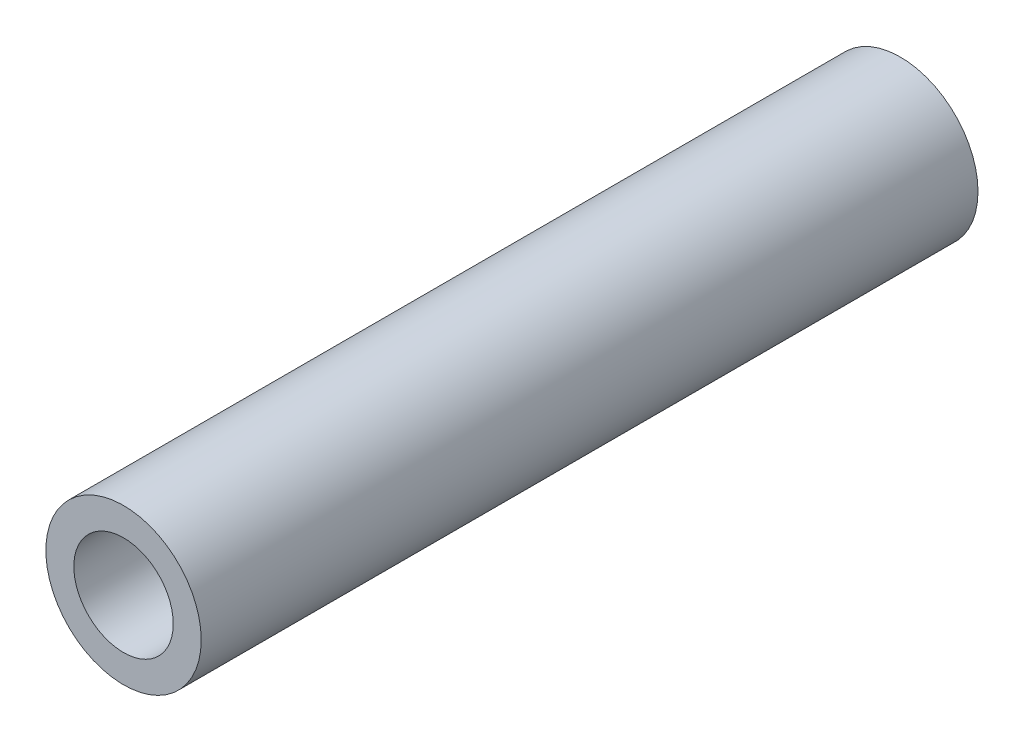
ISO-10303-21;
HEADER;
FILE_DESCRIPTION(('STEP AP214'),'2;1');
FILE_NAME('part.step','',(''),(''),'','','');
FILE_SCHEMA(('AUTOMOTIVE_DESIGN { 1 0 10303 214 1 1 1 1 }'));
ENDSEC;
DATA;
#1=APPLICATION_CONTEXT('core data for automotive mechanical design processes');
#2=APPLICATION_PROTOCOL_DEFINITION('international standard','automotive_design',2000,#1);
#3=PRODUCT_CONTEXT('',#1,'mechanical');
#4=PRODUCT('Part','Part','',(#3));
#5=PRODUCT_RELATED_PRODUCT_CATEGORY('part','',(#4));
#6=PRODUCT_DEFINITION_FORMATION('','',#4);
#7=PRODUCT_DEFINITION_CONTEXT('part definition',#1,'design');
#8=PRODUCT_DEFINITION('design','',#6,#7);
#9=PRODUCT_DEFINITION_SHAPE('','',#8);
#10=(LENGTH_UNIT() NAMED_UNIT(*) SI_UNIT(.MILLI.,.METRE.));
#11=(NAMED_UNIT(*) PLANE_ANGLE_UNIT() SI_UNIT($,.RADIAN.));
#12=(NAMED_UNIT(*) SI_UNIT($,.STERADIAN.) SOLID_ANGLE_UNIT());
#13=UNCERTAINTY_MEASURE_WITH_UNIT(LENGTH_MEASURE(1.E-05),#10,'distance_accuracy_value','');
#14=(GEOMETRIC_REPRESENTATION_CONTEXT(3) GLOBAL_UNCERTAINTY_ASSIGNED_CONTEXT((#13)) GLOBAL_UNIT_ASSIGNED_CONTEXT((#10,
#11,#12)) REPRESENTATION_CONTEXT('',''));
#15=CARTESIAN_POINT('',(0.,0.,0.));
#16=DIRECTION('',(0.,0.,1.));
#17=DIRECTION('',(1.,0.,0.));
#18=AXIS2_PLACEMENT_3D('',#15,#16,#17);
#19=CARTESIAN_POINT('',(0.,0.,25.));
#20=DIRECTION('',(0.,0.,1.));
#21=DIRECTION('',(1.,0.,0.));
#22=AXIS2_PLACEMENT_3D('',#19,#20,#21);
#23=PLANE('',#22);
#24=CARTESIAN_POINT('',(0.,0.,25.));
#25=DIRECTION('',(0.,0.,1.));
#26=DIRECTION('',(1.,0.,0.));
#27=AXIS2_PLACEMENT_3D('',#24,#25,#26);
#28=CIRCLE('',#27,2.5);
#29=CARTESIAN_POINT('',(2.5,0.,25.));
#30=VERTEX_POINT('',#29);
#31=EDGE_CURVE('E10',#30,#30,#28,.T.);
#32=ORIENTED_EDGE('',*,*,#31,.T.);
#33=EDGE_LOOP('',(#32));
#34=FACE_BOUND('',#33,.T.);
#35=CARTESIAN_POINT('',(0.,0.,25.));
#36=DIRECTION('',(0.,0.,1.));
#37=DIRECTION('',(1.,0.,0.));
#38=AXIS2_PLACEMENT_3D('',#35,#36,#37);
#39=CIRCLE('',#38,1.6);
#40=CARTESIAN_POINT('',(1.6,0.,25.));
#41=VERTEX_POINT('',#40);
#42=EDGE_CURVE('E42',#41,#41,#39,.T.);
#43=ORIENTED_EDGE('',*,*,#42,.F.);
#44=EDGE_LOOP('',(#43));
#45=FACE_BOUND('',#44,.T.);
#46=ADVANCED_FACE('F31',(#34,#45),#23,.T.);
#47=CARTESIAN_POINT('',(0.,0.,0.));
#48=DIRECTION('',(0.,0.,1.));
#49=DIRECTION('',(1.,0.,0.));
#50=AXIS2_PLACEMENT_3D('',#47,#48,#49);
#51=PLANE('',#50);
#52=CARTESIAN_POINT('',(0.,0.,0.));
#53=DIRECTION('',(0.,0.,1.));
#54=DIRECTION('',(1.,0.,0.));
#55=AXIS2_PLACEMENT_3D('',#52,#53,#54);
#56=CIRCLE('',#55,2.5);
#57=CARTESIAN_POINT('',(2.5,0.,0.));
#58=VERTEX_POINT('',#57);
#59=EDGE_CURVE('E35',#58,#58,#56,.T.);
#60=ORIENTED_EDGE('',*,*,#59,.F.);
#61=EDGE_LOOP('',(#60));
#62=FACE_BOUND('',#61,.T.);
#63=CARTESIAN_POINT('',(0.,0.,0.));
#64=DIRECTION('',(0.,0.,1.));
#65=DIRECTION('',(1.,0.,0.));
#66=AXIS2_PLACEMENT_3D('',#63,#64,#65);
#67=CIRCLE('',#66,1.6);
#68=CARTESIAN_POINT('',(1.6,0.,0.));
#69=VERTEX_POINT('',#68);
#70=EDGE_CURVE('E44',#69,#69,#67,.T.);
#71=ORIENTED_EDGE('',*,*,#70,.T.);
#72=EDGE_LOOP('',(#71));
#73=FACE_BOUND('',#72,.T.);
#74=ADVANCED_FACE('F54',(#62,#73),#51,.F.);
#75=CARTESIAN_POINT('',(0.,0.,25.));
#76=DIRECTION('',(0.,0.,-1.));
#77=DIRECTION('',(-1.,0.,0.));
#78=AXIS2_PLACEMENT_3D('',#75,#76,#77);
#79=CYLINDRICAL_SURFACE('',#78,2.5);
#80=ORIENTED_EDGE('',*,*,#31,.F.);
#81=EDGE_LOOP('',(#80));
#82=FACE_BOUND('',#81,.T.);
#83=ORIENTED_EDGE('',*,*,#59,.T.);
#84=EDGE_LOOP('',(#83));
#85=FACE_BOUND('',#84,.T.);
#86=ADVANCED_FACE('F33',(#82,#85),#79,.T.);
#87=CARTESIAN_POINT('',(0.,0.,25.));
#88=DIRECTION('',(0.,0.,-1.));
#89=DIRECTION('',(-1.,0.,0.));
#90=AXIS2_PLACEMENT_3D('',#87,#88,#89);
#91=CYLINDRICAL_SURFACE('',#90,1.6);
#92=ORIENTED_EDGE('',*,*,#42,.T.);
#93=EDGE_LOOP('',(#92));
#94=FACE_BOUND('',#93,.T.);
#95=ORIENTED_EDGE('',*,*,#70,.F.);
#96=EDGE_LOOP('',(#95));
#97=FACE_BOUND('',#96,.T.);
#98=ADVANCED_FACE('F50',(#94,#97),#91,.F.);
#99=CLOSED_SHELL('',(#46,#74,#86,#98));
#100=MANIFOLD_SOLID_BREP('B2',#99);
#101=ADVANCED_BREP_SHAPE_REPRESENTATION('',(#18,#100),#14);
#102=SHAPE_DEFINITION_REPRESENTATION(#9,#101);
ENDSEC;
END-ISO-10303-21;
